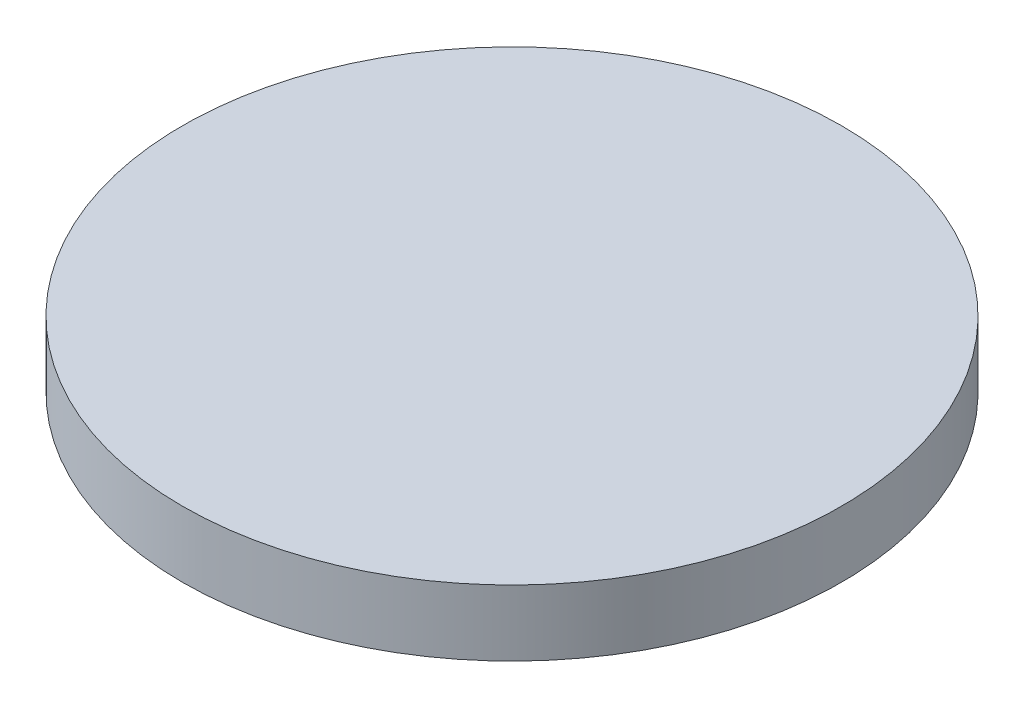
ISO-10303-21;
HEADER;
FILE_DESCRIPTION(('STEP AP214'),'2;1');
FILE_NAME('part.step','',(''),(''),'','','');
FILE_SCHEMA(('AUTOMOTIVE_DESIGN { 1 0 10303 214 1 1 1 1 }'));
ENDSEC;
DATA;
#1=APPLICATION_CONTEXT('core data for automotive mechanical design processes');
#2=APPLICATION_PROTOCOL_DEFINITION('international standard','automotive_design',2000,#1);
#3=PRODUCT_CONTEXT('',#1,'mechanical');
#4=PRODUCT('Part','Part','',(#3));
#5=PRODUCT_RELATED_PRODUCT_CATEGORY('part','',(#4));
#6=PRODUCT_DEFINITION_FORMATION('','',#4);
#7=PRODUCT_DEFINITION_CONTEXT('part definition',#1,'design');
#8=PRODUCT_DEFINITION('design','',#6,#7);
#9=PRODUCT_DEFINITION_SHAPE('','',#8);
#10=(LENGTH_UNIT() NAMED_UNIT(*) SI_UNIT(.MILLI.,.METRE.));
#11=(NAMED_UNIT(*) PLANE_ANGLE_UNIT() SI_UNIT($,.RADIAN.));
#12=(NAMED_UNIT(*) SI_UNIT($,.STERADIAN.) SOLID_ANGLE_UNIT());
#13=UNCERTAINTY_MEASURE_WITH_UNIT(LENGTH_MEASURE(1.E-05),#10,'distance_accuracy_value','');
#14=(GEOMETRIC_REPRESENTATION_CONTEXT(3) GLOBAL_UNCERTAINTY_ASSIGNED_CONTEXT((#13)) GLOBAL_UNIT_ASSIGNED_CONTEXT((#10,
#11,#12)) REPRESENTATION_CONTEXT('',''));
#15=CARTESIAN_POINT('',(0.,0.,0.));
#16=DIRECTION('',(0.,0.,1.));
#17=DIRECTION('',(1.,0.,0.));
#18=AXIS2_PLACEMENT_3D('',#15,#16,#17);
#19=CARTESIAN_POINT('',(0.,3.,0.));
#20=DIRECTION('',(0.,-1.,0.));
#21=DIRECTION('',(0.,0.,-1.));
#22=AXIS2_PLACEMENT_3D('',#19,#20,#21);
#23=CYLINDRICAL_SURFACE('',#22,15.);
#24=CARTESIAN_POINT('',(0.,3.,0.));
#25=DIRECTION('',(0.,1.,0.));
#26=DIRECTION('',(0.,0.,1.));
#27=AXIS2_PLACEMENT_3D('',#24,#25,#26);
#28=CIRCLE('',#27,15.);
#29=CARTESIAN_POINT('',(0.,3.,15.));
#30=VERTEX_POINT('',#29);
#31=EDGE_CURVE('E10',#30,#30,#28,.T.);
#32=ORIENTED_EDGE('',*,*,#31,.F.);
#33=EDGE_LOOP('',(#32));
#34=FACE_BOUND('',#33,.T.);
#35=CARTESIAN_POINT('',(0.,0.,0.));
#36=DIRECTION('',(0.,1.,0.));
#37=DIRECTION('',(0.,0.,1.));
#38=AXIS2_PLACEMENT_3D('',#35,#36,#37);
#39=CIRCLE('',#38,15.);
#40=CARTESIAN_POINT('',(0.,0.,15.));
#41=VERTEX_POINT('',#40);
#42=EDGE_CURVE('E33',#41,#41,#39,.T.);
#43=ORIENTED_EDGE('',*,*,#42,.T.);
#44=EDGE_LOOP('',(#43));
#45=FACE_BOUND('',#44,.T.);
#46=ADVANCED_FACE('F30',(#34,#45),#23,.T.);
#47=CARTESIAN_POINT('',(0.,3.,0.));
#48=DIRECTION('',(0.,1.,0.));
#49=DIRECTION('',(0.,0.,1.));
#50=AXIS2_PLACEMENT_3D('',#47,#48,#49);
#51=PLANE('',#50);
#52=ORIENTED_EDGE('',*,*,#31,.T.);
#53=EDGE_LOOP('',(#52));
#54=FACE_BOUND('',#53,.T.);
#55=ADVANCED_FACE('F45',(#54),#51,.T.);
#56=CARTESIAN_POINT('',(0.,0.,0.));
#57=DIRECTION('',(0.,1.,0.));
#58=DIRECTION('',(0.,0.,1.));
#59=AXIS2_PLACEMENT_3D('',#56,#57,#58);
#60=PLANE('',#59);
#61=ORIENTED_EDGE('',*,*,#42,.F.);
#62=EDGE_LOOP('',(#61));
#63=FACE_BOUND('',#62,.T.);
#64=ADVANCED_FACE('F43',(#63),#60,.F.);
#65=CLOSED_SHELL('',(#46,#55,#64));
#66=MANIFOLD_SOLID_BREP('B2',#65);
#67=ADVANCED_BREP_SHAPE_REPRESENTATION('',(#18,#66),#14);
#68=SHAPE_DEFINITION_REPRESENTATION(#9,#67);
ENDSEC;
END-ISO-10303-21;
